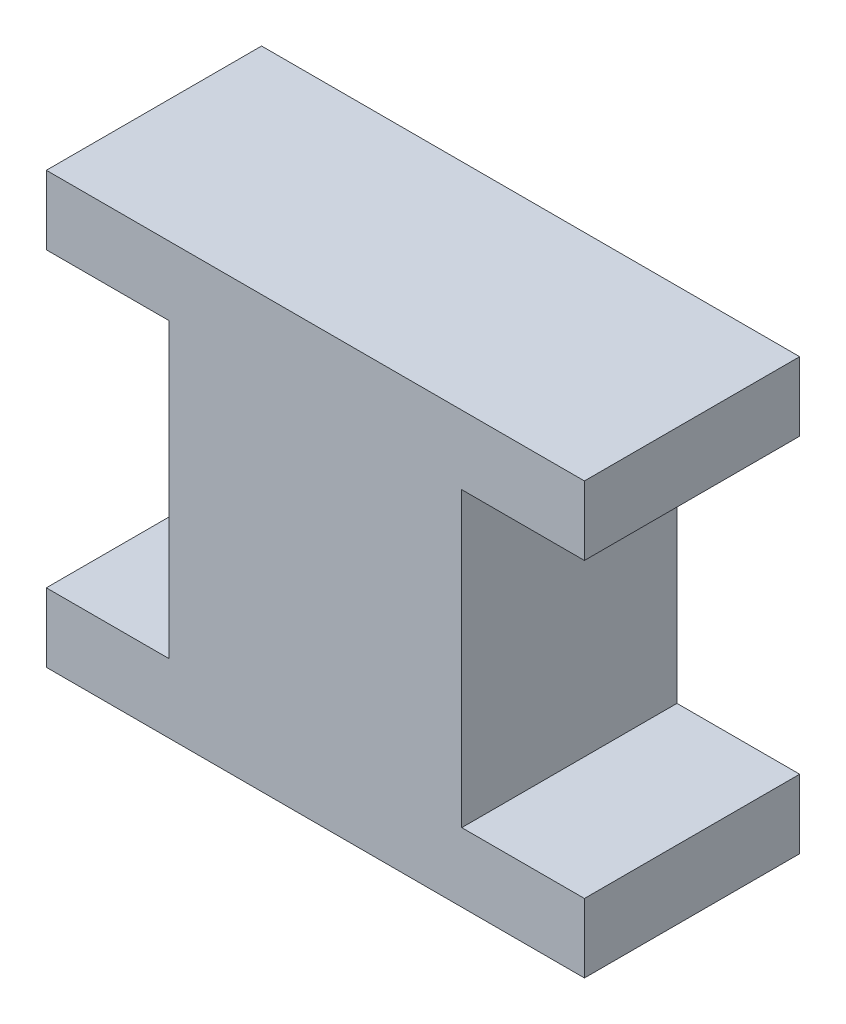
ISO-10303-21;
HEADER;
FILE_DESCRIPTION(('STEP AP214'),'2;1');
FILE_NAME('part.step','',(''),(''),'','','');
FILE_SCHEMA(('AUTOMOTIVE_DESIGN { 1 0 10303 214 1 1 1 1 }'));
ENDSEC;
DATA;
#1=APPLICATION_CONTEXT('core data for automotive mechanical design processes');
#2=APPLICATION_PROTOCOL_DEFINITION('international standard','automotive_design',2000,#1);
#3=PRODUCT_CONTEXT('',#1,'mechanical');
#4=PRODUCT('Part','Part','',(#3));
#5=PRODUCT_RELATED_PRODUCT_CATEGORY('part','',(#4));
#6=PRODUCT_DEFINITION_FORMATION('','',#4);
#7=PRODUCT_DEFINITION_CONTEXT('part definition',#1,'design');
#8=PRODUCT_DEFINITION('design','',#6,#7);
#9=PRODUCT_DEFINITION_SHAPE('','',#8);
#10=(LENGTH_UNIT() NAMED_UNIT(*) SI_UNIT(.MILLI.,.METRE.));
#11=(NAMED_UNIT(*) PLANE_ANGLE_UNIT() SI_UNIT($,.RADIAN.));
#12=(NAMED_UNIT(*) SI_UNIT($,.STERADIAN.) SOLID_ANGLE_UNIT());
#13=UNCERTAINTY_MEASURE_WITH_UNIT(LENGTH_MEASURE(1.E-05),#10,'distance_accuracy_value','');
#14=(GEOMETRIC_REPRESENTATION_CONTEXT(3) GLOBAL_UNCERTAINTY_ASSIGNED_CONTEXT((#13)) GLOBAL_UNIT_ASSIGNED_CONTEXT((#10,
#11,#12)) REPRESENTATION_CONTEXT('',''));
#15=CARTESIAN_POINT('',(0.,0.,0.));
#16=DIRECTION('',(0.,0.,1.));
#17=DIRECTION('',(1.,0.,0.));
#18=AXIS2_PLACEMENT_3D('',#15,#16,#17);
#19=CARTESIAN_POINT('',(6.35,3.4544,5.08));
#20=DIRECTION('',(-1.,0.,0.));
#21=DIRECTION('',(0.,0.,1.));
#22=AXIS2_PLACEMENT_3D('',#19,#20,#21);
#23=PLANE('',#22);
#24=DIRECTION('',(0.,1.,0.));
#25=VECTOR('',#24,1.);
#26=CARTESIAN_POINT('',(6.35,3.4544,0.));
#27=LINE('',#26,#25);
#28=CARTESIAN_POINT('',(6.35,3.4544,0.));
#29=VERTEX_POINT('',#28);
#30=CARTESIAN_POINT('',(6.35,5.08,0.));
#31=VERTEX_POINT('',#30);
#32=EDGE_CURVE('E154',#29,#31,#27,.T.);
#33=ORIENTED_EDGE('',*,*,#32,.T.);
#34=DIRECTION('',(0.,0.,-1.));
#35=VECTOR('',#34,1.);
#36=CARTESIAN_POINT('',(6.35,5.08,5.08));
#37=LINE('',#36,#35);
#38=CARTESIAN_POINT('',(6.35,5.08,5.08));
#39=VERTEX_POINT('',#38);
#40=EDGE_CURVE('E11',#39,#31,#37,.T.);
#41=ORIENTED_EDGE('',*,*,#40,.F.);
#42=DIRECTION('',(0.,1.,0.));
#43=VECTOR('',#42,1.);
#44=CARTESIAN_POINT('',(6.35,3.4544,5.08));
#45=LINE('',#44,#43);
#46=CARTESIAN_POINT('',(6.35,3.4544,5.08));
#47=VERTEX_POINT('',#46);
#48=EDGE_CURVE('E184',#47,#39,#45,.T.);
#49=ORIENTED_EDGE('',*,*,#48,.F.);
#50=DIRECTION('',(0.,0.,-1.));
#51=VECTOR('',#50,1.);
#52=CARTESIAN_POINT('',(6.35,3.4544,5.08));
#53=LINE('',#52,#51);
#54=EDGE_CURVE('E49',#47,#29,#53,.T.);
#55=ORIENTED_EDGE('',*,*,#54,.T.);
#56=EDGE_LOOP('',(#33,#41,#49,#55));
#57=FACE_BOUND('',#56,.T.);
#58=ADVANCED_FACE('F33',(#57),#23,.F.);
#59=CARTESIAN_POINT('',(6.35,5.08,5.08));
#60=DIRECTION('',(0.,-1.,0.));
#61=DIRECTION('',(1.,0.,0.));
#62=AXIS2_PLACEMENT_3D('',#59,#60,#61);
#63=PLANE('',#62);
#64=DIRECTION('',(-1.,0.,0.));
#65=VECTOR('',#64,1.);
#66=CARTESIAN_POINT('',(6.35,5.08,0.));
#67=LINE('',#66,#65);
#68=CARTESIAN_POINT('',(-6.35,5.08,0.));
#69=VERTEX_POINT('',#68);
#70=EDGE_CURVE('E156',#31,#69,#67,.T.);
#71=ORIENTED_EDGE('',*,*,#70,.T.);
#72=DIRECTION('',(0.,0.,-1.));
#73=VECTOR('',#72,1.);
#74=CARTESIAN_POINT('',(-6.35,5.08,5.08));
#75=LINE('',#74,#73);
#76=CARTESIAN_POINT('',(-6.35,5.08,5.08));
#77=VERTEX_POINT('',#76);
#78=EDGE_CURVE('E41',#77,#69,#75,.T.);
#79=ORIENTED_EDGE('',*,*,#78,.F.);
#80=DIRECTION('',(-1.,0.,0.));
#81=VECTOR('',#80,1.);
#82=CARTESIAN_POINT('',(6.35,5.08,5.08));
#83=LINE('',#82,#81);
#84=EDGE_CURVE('E99',#39,#77,#83,.T.);
#85=ORIENTED_EDGE('',*,*,#84,.F.);
#86=ORIENTED_EDGE('',*,*,#40,.T.);
#87=EDGE_LOOP('',(#71,#79,#85,#86));
#88=FACE_BOUND('',#87,.T.);
#89=ADVANCED_FACE('F207',(#88),#63,.F.);
#90=CARTESIAN_POINT('',(-6.35,3.4544,5.08));
#91=DIRECTION('',(-1.,0.,0.));
#92=DIRECTION('',(0.,0.,1.));
#93=AXIS2_PLACEMENT_3D('',#90,#91,#92);
#94=PLANE('',#93);
#95=DIRECTION('',(0.,1.,0.));
#96=VECTOR('',#95,1.);
#97=CARTESIAN_POINT('',(-6.35,3.4544,0.));
#98=LINE('',#97,#96);
#99=CARTESIAN_POINT('',(-6.35,3.4544,0.));
#100=VERTEX_POINT('',#99);
#101=EDGE_CURVE('E159',#100,#69,#98,.T.);
#102=ORIENTED_EDGE('',*,*,#101,.F.);
#103=DIRECTION('',(0.,0.,-1.));
#104=VECTOR('',#103,1.);
#105=CARTESIAN_POINT('',(-6.35,3.4544,5.08));
#106=LINE('',#105,#104);
#107=CARTESIAN_POINT('',(-6.35,3.4544,5.08));
#108=VERTEX_POINT('',#107);
#109=EDGE_CURVE('E200',#108,#100,#106,.T.);
#110=ORIENTED_EDGE('',*,*,#109,.F.);
#111=DIRECTION('',(0.,1.,0.));
#112=VECTOR('',#111,1.);
#113=CARTESIAN_POINT('',(-6.35,3.4544,5.08));
#114=LINE('',#113,#112);
#115=EDGE_CURVE('E206',#108,#77,#114,.T.);
#116=ORIENTED_EDGE('',*,*,#115,.T.);
#117=ORIENTED_EDGE('',*,*,#78,.T.);
#118=EDGE_LOOP('',(#102,#110,#116,#117));
#119=FACE_BOUND('',#118,.T.);
#120=ADVANCED_FACE('F204',(#119),#94,.T.);
#121=CARTESIAN_POINT('',(-3.4544,3.4544,5.08));
#122=DIRECTION('',(0.,-1.,0.));
#123=DIRECTION('',(1.,0.,0.));
#124=AXIS2_PLACEMENT_3D('',#121,#122,#123);
#125=PLANE('',#124);
#126=DIRECTION('',(-1.,0.,0.));
#127=VECTOR('',#126,1.);
#128=CARTESIAN_POINT('',(-3.4544,3.4544,0.));
#129=LINE('',#128,#127);
#130=CARTESIAN_POINT('',(-3.4544,3.4544,0.));
#131=VERTEX_POINT('',#130);
#132=EDGE_CURVE('E162',#131,#100,#129,.T.);
#133=ORIENTED_EDGE('',*,*,#132,.F.);
#134=DIRECTION('',(0.,0.,-1.));
#135=VECTOR('',#134,1.);
#136=CARTESIAN_POINT('',(-3.4544,3.4544,5.08));
#137=LINE('',#136,#135);
#138=CARTESIAN_POINT('',(-3.4544,3.4544,5.08));
#139=VERTEX_POINT('',#138);
#140=EDGE_CURVE('E198',#139,#131,#137,.T.);
#141=ORIENTED_EDGE('',*,*,#140,.F.);
#142=DIRECTION('',(-1.,0.,0.));
#143=VECTOR('',#142,1.);
#144=CARTESIAN_POINT('',(-3.4544,3.4544,5.08));
#145=LINE('',#144,#143);
#146=EDGE_CURVE('E219',#139,#108,#145,.T.);
#147=ORIENTED_EDGE('',*,*,#146,.T.);
#148=ORIENTED_EDGE('',*,*,#109,.T.);
#149=EDGE_LOOP('',(#133,#141,#147,#148));
#150=FACE_BOUND('',#149,.T.);
#151=ADVANCED_FACE('F215',(#150),#125,.T.);
#152=CARTESIAN_POINT('',(-3.4544,3.4544,5.08));
#153=DIRECTION('',(1.,0.,0.));
#154=DIRECTION('',(0.,1.,0.));
#155=AXIS2_PLACEMENT_3D('',#152,#153,#154);
#156=PLANE('',#155);
#157=DIRECTION('',(0.,-1.,0.));
#158=VECTOR('',#157,1.);
#159=CARTESIAN_POINT('',(-3.4544,3.4544,0.));
#160=LINE('',#159,#158);
#161=CARTESIAN_POINT('',(-3.4544,-3.4544,0.));
#162=VERTEX_POINT('',#161);
#163=EDGE_CURVE('E165',#131,#162,#160,.T.);
#164=ORIENTED_EDGE('',*,*,#163,.T.);
#165=DIRECTION('',(0.,0.,-1.));
#166=VECTOR('',#165,1.);
#167=CARTESIAN_POINT('',(-3.4544,-3.4544,5.08));
#168=LINE('',#167,#166);
#169=CARTESIAN_POINT('',(-3.4544,-3.4544,5.08));
#170=VERTEX_POINT('',#169);
#171=EDGE_CURVE('E195',#170,#162,#168,.T.);
#172=ORIENTED_EDGE('',*,*,#171,.F.);
#173=DIRECTION('',(0.,-1.,0.));
#174=VECTOR('',#173,1.);
#175=CARTESIAN_POINT('',(-3.4544,3.4544,5.08));
#176=LINE('',#175,#174);
#177=EDGE_CURVE('E221',#139,#170,#176,.T.);
#178=ORIENTED_EDGE('',*,*,#177,.F.);
#179=ORIENTED_EDGE('',*,*,#140,.T.);
#180=EDGE_LOOP('',(#164,#172,#178,#179));
#181=FACE_BOUND('',#180,.T.);
#182=ADVANCED_FACE('F258',(#181),#156,.F.);
#183=CARTESIAN_POINT('',(-3.4544,-3.4544,5.08));
#184=DIRECTION('',(0.,-1.,0.));
#185=DIRECTION('',(1.,0.,0.));
#186=AXIS2_PLACEMENT_3D('',#183,#184,#185);
#187=PLANE('',#186);
#188=DIRECTION('',(-1.,0.,0.));
#189=VECTOR('',#188,1.);
#190=CARTESIAN_POINT('',(-3.4544,-3.4544,0.));
#191=LINE('',#190,#189);
#192=CARTESIAN_POINT('',(-6.35,-3.4544,0.));
#193=VERTEX_POINT('',#192);
#194=EDGE_CURVE('E167',#162,#193,#191,.T.);
#195=ORIENTED_EDGE('',*,*,#194,.T.);
#196=DIRECTION('',(0.,0.,-1.));
#197=VECTOR('',#196,1.);
#198=CARTESIAN_POINT('',(-6.35,-3.4544,5.08));
#199=LINE('',#198,#197);
#200=CARTESIAN_POINT('',(-6.35,-3.4544,5.08));
#201=VERTEX_POINT('',#200);
#202=EDGE_CURVE('E192',#201,#193,#199,.T.);
#203=ORIENTED_EDGE('',*,*,#202,.F.);
#204=DIRECTION('',(-1.,0.,0.));
#205=VECTOR('',#204,1.);
#206=CARTESIAN_POINT('',(-3.4544,-3.4544,5.08));
#207=LINE('',#206,#205);
#208=EDGE_CURVE('E227',#170,#201,#207,.T.);
#209=ORIENTED_EDGE('',*,*,#208,.F.);
#210=ORIENTED_EDGE('',*,*,#171,.T.);
#211=EDGE_LOOP('',(#195,#203,#209,#210));
#212=FACE_BOUND('',#211,.T.);
#213=ADVANCED_FACE('F261',(#212),#187,.F.);
#214=CARTESIAN_POINT('',(-6.35,-3.4544,5.08));
#215=DIRECTION('',(1.,0.,0.));
#216=DIRECTION('',(0.,0.,-1.));
#217=AXIS2_PLACEMENT_3D('',#214,#215,#216);
#218=PLANE('',#217);
#219=DIRECTION('',(0.,-1.,0.));
#220=VECTOR('',#219,1.);
#221=CARTESIAN_POINT('',(-6.35,-3.4544,0.));
#222=LINE('',#221,#220);
#223=CARTESIAN_POINT('',(-6.35,-5.08,0.));
#224=VERTEX_POINT('',#223);
#225=EDGE_CURVE('E169',#193,#224,#222,.T.);
#226=ORIENTED_EDGE('',*,*,#225,.T.);
#227=DIRECTION('',(0.,0.,-1.));
#228=VECTOR('',#227,1.);
#229=CARTESIAN_POINT('',(-6.35,-5.08,5.08));
#230=LINE('',#229,#228);
#231=CARTESIAN_POINT('',(-6.35,-5.08,5.08));
#232=VERTEX_POINT('',#231);
#233=EDGE_CURVE('E190',#232,#224,#230,.T.);
#234=ORIENTED_EDGE('',*,*,#233,.F.);
#235=DIRECTION('',(0.,-1.,0.));
#236=VECTOR('',#235,1.);
#237=CARTESIAN_POINT('',(-6.35,-3.4544,5.08));
#238=LINE('',#237,#236);
#239=EDGE_CURVE('E229',#201,#232,#238,.T.);
#240=ORIENTED_EDGE('',*,*,#239,.F.);
#241=ORIENTED_EDGE('',*,*,#202,.T.);
#242=EDGE_LOOP('',(#226,#234,#240,#241));
#243=FACE_BOUND('',#242,.T.);
#244=ADVANCED_FACE('F265',(#243),#218,.F.);
#245=CARTESIAN_POINT('',(6.35,-5.08,5.08));
#246=DIRECTION('',(0.,-1.,0.));
#247=DIRECTION('',(1.,0.,0.));
#248=AXIS2_PLACEMENT_3D('',#245,#246,#247);
#249=PLANE('',#248);
#250=DIRECTION('',(-1.,0.,0.));
#251=VECTOR('',#250,1.);
#252=CARTESIAN_POINT('',(6.35,-5.08,0.));
#253=LINE('',#252,#251);
#254=CARTESIAN_POINT('',(6.35,-5.08,0.));
#255=VERTEX_POINT('',#254);
#256=EDGE_CURVE('E172',#255,#224,#253,.T.);
#257=ORIENTED_EDGE('',*,*,#256,.F.);
#258=DIRECTION('',(0.,0.,-1.));
#259=VECTOR('',#258,1.);
#260=CARTESIAN_POINT('',(6.35,-5.08,5.08));
#261=LINE('',#260,#259);
#262=CARTESIAN_POINT('',(6.35,-5.08,5.08));
#263=VERTEX_POINT('',#262);
#264=EDGE_CURVE('E188',#263,#255,#261,.T.);
#265=ORIENTED_EDGE('',*,*,#264,.F.);
#266=DIRECTION('',(-1.,0.,0.));
#267=VECTOR('',#266,1.);
#268=CARTESIAN_POINT('',(6.35,-5.08,5.08));
#269=LINE('',#268,#267);
#270=EDGE_CURVE('E231',#263,#232,#269,.T.);
#271=ORIENTED_EDGE('',*,*,#270,.T.);
#272=ORIENTED_EDGE('',*,*,#233,.T.);
#273=EDGE_LOOP('',(#257,#265,#271,#272));
#274=FACE_BOUND('',#273,.T.);
#275=ADVANCED_FACE('F269',(#274),#249,.T.);
#276=CARTESIAN_POINT('',(6.35,-3.4544,5.08));
#277=DIRECTION('',(1.,0.,0.));
#278=DIRECTION('',(0.,0.,-1.));
#279=AXIS2_PLACEMENT_3D('',#276,#277,#278);
#280=PLANE('',#279);
#281=DIRECTION('',(0.,-1.,0.));
#282=VECTOR('',#281,1.);
#283=CARTESIAN_POINT('',(6.35,-3.4544,0.));
#284=LINE('',#283,#282);
#285=CARTESIAN_POINT('',(6.35,-3.4544,0.));
#286=VERTEX_POINT('',#285);
#287=EDGE_CURVE('E175',#286,#255,#284,.T.);
#288=ORIENTED_EDGE('',*,*,#287,.F.);
#289=DIRECTION('',(0.,0.,-1.));
#290=VECTOR('',#289,1.);
#291=CARTESIAN_POINT('',(6.35,-3.4544,5.08));
#292=LINE('',#291,#290);
#293=CARTESIAN_POINT('',(6.35,-3.4544,5.08));
#294=VERTEX_POINT('',#293);
#295=EDGE_CURVE('E146',#294,#286,#292,.T.);
#296=ORIENTED_EDGE('',*,*,#295,.F.);
#297=DIRECTION('',(0.,-1.,0.));
#298=VECTOR('',#297,1.);
#299=CARTESIAN_POINT('',(6.35,-3.4544,5.08));
#300=LINE('',#299,#298);
#301=EDGE_CURVE('E136',#294,#263,#300,.T.);
#302=ORIENTED_EDGE('',*,*,#301,.T.);
#303=ORIENTED_EDGE('',*,*,#264,.T.);
#304=EDGE_LOOP('',(#288,#296,#302,#303));
#305=FACE_BOUND('',#304,.T.);
#306=ADVANCED_FACE('F235',(#305),#280,.T.);
#307=CARTESIAN_POINT('',(6.35,-3.4544,5.08));
#308=DIRECTION('',(0.,-1.,0.));
#309=DIRECTION('',(0.,0.,-1.));
#310=AXIS2_PLACEMENT_3D('',#307,#308,#309);
#311=PLANE('',#310);
#312=DIRECTION('',(-1.,0.,0.));
#313=VECTOR('',#312,1.);
#314=CARTESIAN_POINT('',(6.35,-3.4544,0.));
#315=LINE('',#314,#313);
#316=CARTESIAN_POINT('',(3.4544,-3.4544,0.));
#317=VERTEX_POINT('',#316);
#318=EDGE_CURVE('E143',#286,#317,#315,.T.);
#319=ORIENTED_EDGE('',*,*,#318,.T.);
#320=DIRECTION('',(0.,0.,-1.));
#321=VECTOR('',#320,1.);
#322=CARTESIAN_POINT('',(3.4544,-3.4544,5.08));
#323=LINE('',#322,#321);
#324=CARTESIAN_POINT('',(3.4544,-3.4544,5.08));
#325=VERTEX_POINT('',#324);
#326=EDGE_CURVE('E140',#325,#317,#323,.T.);
#327=ORIENTED_EDGE('',*,*,#326,.F.);
#328=DIRECTION('',(-1.,0.,0.));
#329=VECTOR('',#328,1.);
#330=CARTESIAN_POINT('',(6.35,-3.4544,5.08));
#331=LINE('',#330,#329);
#332=EDGE_CURVE('E128',#294,#325,#331,.T.);
#333=ORIENTED_EDGE('',*,*,#332,.F.);
#334=ORIENTED_EDGE('',*,*,#295,.T.);
#335=EDGE_LOOP('',(#319,#327,#333,#334));
#336=FACE_BOUND('',#335,.T.);
#337=ADVANCED_FACE('F141',(#336),#311,.F.);
#338=CARTESIAN_POINT('',(3.4544,3.4544,5.08));
#339=DIRECTION('',(1.,0.,0.));
#340=DIRECTION('',(0.,1.,0.));
#341=AXIS2_PLACEMENT_3D('',#338,#339,#340);
#342=PLANE('',#341);
#343=DIRECTION('',(0.,-1.,0.));
#344=VECTOR('',#343,1.);
#345=CARTESIAN_POINT('',(3.4544,3.4544,0.));
#346=LINE('',#345,#344);
#347=CARTESIAN_POINT('',(3.4544,3.4544,0.));
#348=VERTEX_POINT('',#347);
#349=EDGE_CURVE('E179',#348,#317,#346,.T.);
#350=ORIENTED_EDGE('',*,*,#349,.F.);
#351=DIRECTION('',(0.,0.,-1.));
#352=VECTOR('',#351,1.);
#353=CARTESIAN_POINT('',(3.4544,3.4544,5.08));
#354=LINE('',#353,#352);
#355=CARTESIAN_POINT('',(3.4544,3.4544,5.08));
#356=VERTEX_POINT('',#355);
#357=EDGE_CURVE('E87',#356,#348,#354,.T.);
#358=ORIENTED_EDGE('',*,*,#357,.F.);
#359=DIRECTION('',(0.,-1.,0.));
#360=VECTOR('',#359,1.);
#361=CARTESIAN_POINT('',(3.4544,3.4544,5.08));
#362=LINE('',#361,#360);
#363=EDGE_CURVE('E133',#356,#325,#362,.T.);
#364=ORIENTED_EDGE('',*,*,#363,.T.);
#365=ORIENTED_EDGE('',*,*,#326,.T.);
#366=EDGE_LOOP('',(#350,#358,#364,#365));
#367=FACE_BOUND('',#366,.T.);
#368=ADVANCED_FACE('F148',(#367),#342,.T.);
#369=CARTESIAN_POINT('',(6.35,3.4544,5.08));
#370=DIRECTION('',(0.,-1.,0.));
#371=DIRECTION('',(0.,0.,-1.));
#372=AXIS2_PLACEMENT_3D('',#369,#370,#371);
#373=PLANE('',#372);
#374=DIRECTION('',(-1.,0.,0.));
#375=VECTOR('',#374,1.);
#376=CARTESIAN_POINT('',(6.35,3.4544,0.));
#377=LINE('',#376,#375);
#378=EDGE_CURVE('E181',#29,#348,#377,.T.);
#379=ORIENTED_EDGE('',*,*,#378,.F.);
#380=ORIENTED_EDGE('',*,*,#54,.F.);
#381=DIRECTION('',(-1.,0.,0.));
#382=VECTOR('',#381,1.);
#383=CARTESIAN_POINT('',(6.35,3.4544,5.08));
#384=LINE('',#383,#382);
#385=EDGE_CURVE('E149',#47,#356,#384,.T.);
#386=ORIENTED_EDGE('',*,*,#385,.T.);
#387=ORIENTED_EDGE('',*,*,#357,.T.);
#388=EDGE_LOOP('',(#379,#380,#386,#387));
#389=FACE_BOUND('',#388,.T.);
#390=ADVANCED_FACE('F237',(#389),#373,.T.);
#391=CARTESIAN_POINT('',(0.,0.,5.08));
#392=DIRECTION('',(0.,0.,1.));
#393=DIRECTION('',(1.,0.,0.));
#394=AXIS2_PLACEMENT_3D('',#391,#392,#393);
#395=PLANE('',#394);
#396=ORIENTED_EDGE('',*,*,#48,.T.);
#397=ORIENTED_EDGE('',*,*,#84,.T.);
#398=ORIENTED_EDGE('',*,*,#115,.F.);
#399=ORIENTED_EDGE('',*,*,#146,.F.);
#400=ORIENTED_EDGE('',*,*,#177,.T.);
#401=ORIENTED_EDGE('',*,*,#208,.T.);
#402=ORIENTED_EDGE('',*,*,#239,.T.);
#403=ORIENTED_EDGE('',*,*,#270,.F.);
#404=ORIENTED_EDGE('',*,*,#301,.F.);
#405=ORIENTED_EDGE('',*,*,#332,.T.);
#406=ORIENTED_EDGE('',*,*,#363,.F.);
#407=ORIENTED_EDGE('',*,*,#385,.F.);
#408=EDGE_LOOP('',(#396,#397,#398,#399,#400,#401,#402,#403,#404,#405,#406,#407));
#409=FACE_BOUND('',#408,.T.);
#410=ADVANCED_FACE('F130',(#409),#395,.T.);
#411=CARTESIAN_POINT('',(0.,0.,0.));
#412=DIRECTION('',(0.,0.,1.));
#413=DIRECTION('',(1.,0.,0.));
#414=AXIS2_PLACEMENT_3D('',#411,#412,#413);
#415=PLANE('',#414);
#416=ORIENTED_EDGE('',*,*,#32,.F.);
#417=ORIENTED_EDGE('',*,*,#378,.T.);
#418=ORIENTED_EDGE('',*,*,#349,.T.);
#419=ORIENTED_EDGE('',*,*,#318,.F.);
#420=ORIENTED_EDGE('',*,*,#287,.T.);
#421=ORIENTED_EDGE('',*,*,#256,.T.);
#422=ORIENTED_EDGE('',*,*,#225,.F.);
#423=ORIENTED_EDGE('',*,*,#194,.F.);
#424=ORIENTED_EDGE('',*,*,#163,.F.);
#425=ORIENTED_EDGE('',*,*,#132,.T.);
#426=ORIENTED_EDGE('',*,*,#101,.T.);
#427=ORIENTED_EDGE('',*,*,#70,.F.);
#428=EDGE_LOOP('',(#416,#417,#418,#419,#420,#421,#422,#423,#424,#425,#426,#427));
#429=FACE_BOUND('',#428,.T.);
#430=ADVANCED_FACE('F210',(#429),#415,.F.);
#431=CLOSED_SHELL('',(#58,#89,#120,#151,#182,#213,#244,#275,#306,#337,#368,#390,#410,#430));
#432=MANIFOLD_SOLID_BREP('B2',#431);
#433=ADVANCED_BREP_SHAPE_REPRESENTATION('',(#18,#432),#14);
#434=SHAPE_DEFINITION_REPRESENTATION(#9,#433);
ENDSEC;
END-ISO-10303-21;
